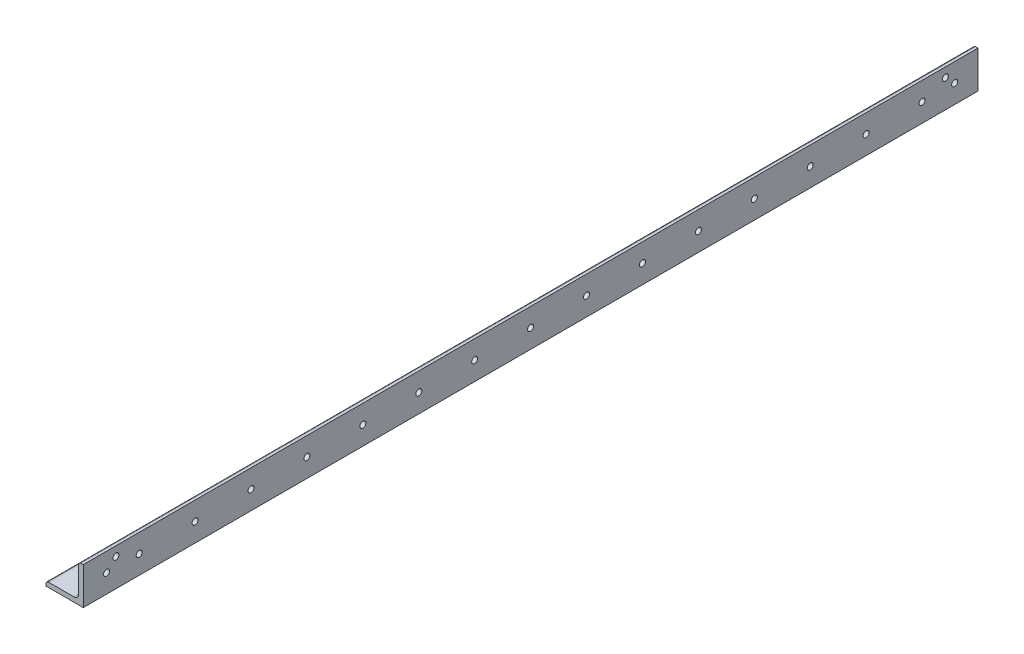
ISO-10303-21;
HEADER;
FILE_DESCRIPTION(('STEP AP214'),'2;1');
FILE_NAME('part.step','',(''),(''),'','','');
FILE_SCHEMA(('AUTOMOTIVE_DESIGN { 1 0 10303 214 1 1 1 1 }'));
ENDSEC;
DATA;
#1=APPLICATION_CONTEXT('core data for automotive mechanical design processes');
#2=APPLICATION_PROTOCOL_DEFINITION('international standard','automotive_design',2000,#1);
#3=PRODUCT_CONTEXT('',#1,'mechanical');
#4=PRODUCT('Part','Part','',(#3));
#5=PRODUCT_RELATED_PRODUCT_CATEGORY('part','',(#4));
#6=PRODUCT_DEFINITION_FORMATION('','',#4);
#7=PRODUCT_DEFINITION_CONTEXT('part definition',#1,'design');
#8=PRODUCT_DEFINITION('design','',#6,#7);
#9=PRODUCT_DEFINITION_SHAPE('','',#8);
#10=(LENGTH_UNIT() NAMED_UNIT(*) SI_UNIT(.MILLI.,.METRE.));
#11=(NAMED_UNIT(*) PLANE_ANGLE_UNIT() SI_UNIT($,.RADIAN.));
#12=(NAMED_UNIT(*) SI_UNIT($,.STERADIAN.) SOLID_ANGLE_UNIT());
#13=UNCERTAINTY_MEASURE_WITH_UNIT(LENGTH_MEASURE(1.E-05),#10,'distance_accuracy_value','');
#14=(GEOMETRIC_REPRESENTATION_CONTEXT(3) GLOBAL_UNCERTAINTY_ASSIGNED_CONTEXT((#13)) GLOBAL_UNIT_ASSIGNED_CONTEXT((#10,
#11,#12)) REPRESENTATION_CONTEXT('',''));
#15=CARTESIAN_POINT('',(0.,0.,0.));
#16=DIRECTION('',(0.,0.,1.));
#17=DIRECTION('',(1.,0.,0.));
#18=AXIS2_PLACEMENT_3D('',#15,#16,#17);
#19=CARTESIAN_POINT('',(-12.7,-11.1125,304.8));
#20=DIRECTION('',(1.,0.,0.));
#21=DIRECTION('',(0.,0.,-1.));
#22=AXIS2_PLACEMENT_3D('',#19,#20,#21);
#23=PLANE('',#22);
#24=DIRECTION('',(0.,-1.,0.));
#25=VECTOR('',#24,1.);
#26=CARTESIAN_POINT('',(-12.7,-11.1125,-304.8));
#27=LINE('',#26,#25);
#28=CARTESIAN_POINT('',(-12.7,-11.1125,-304.8));
#29=VERTEX_POINT('',#28);
#30=CARTESIAN_POINT('',(-12.7,-12.7,-304.8));
#31=VERTEX_POINT('',#30);
#32=EDGE_CURVE('E144',#29,#31,#27,.T.);
#33=ORIENTED_EDGE('',*,*,#32,.T.);
#34=DIRECTION('',(0.,0.,-1.));
#35=VECTOR('',#34,1.);
#36=CARTESIAN_POINT('',(-12.7,-12.7,304.8));
#37=LINE('',#36,#35);
#38=CARTESIAN_POINT('',(-12.7,-12.7,304.8));
#39=VERTEX_POINT('',#38);
#40=EDGE_CURVE('E11',#39,#31,#37,.T.);
#41=ORIENTED_EDGE('',*,*,#40,.F.);
#42=DIRECTION('',(0.,-1.,0.));
#43=VECTOR('',#42,1.);
#44=CARTESIAN_POINT('',(-12.7,-11.1125,304.8));
#45=LINE('',#44,#43);
#46=CARTESIAN_POINT('',(-12.7,-11.1125,304.8));
#47=VERTEX_POINT('',#46);
#48=EDGE_CURVE('E160',#47,#39,#45,.T.);
#49=ORIENTED_EDGE('',*,*,#48,.F.);
#50=DIRECTION('',(0.,0.,-1.));
#51=VECTOR('',#50,1.);
#52=CARTESIAN_POINT('',(-12.7,-11.1125,304.8));
#53=LINE('',#52,#51);
#54=EDGE_CURVE('E140',#47,#29,#53,.T.);
#55=ORIENTED_EDGE('',*,*,#54,.T.);
#56=EDGE_LOOP('',(#33,#41,#49,#55));
#57=FACE_BOUND('',#56,.T.);
#58=ADVANCED_FACE('F40',(#57),#23,.F.);
#59=CARTESIAN_POINT('',(-12.7,-12.7,304.8));
#60=DIRECTION('',(0.,1.,0.));
#61=DIRECTION('',(-1.,0.,0.));
#62=AXIS2_PLACEMENT_3D('',#59,#60,#61);
#63=PLANE('',#62);
#64=DIRECTION('',(1.,0.,0.));
#65=VECTOR('',#64,1.);
#66=CARTESIAN_POINT('',(-12.7,-12.7,-304.8));
#67=LINE('',#66,#65);
#68=CARTESIAN_POINT('',(12.7,-12.7,-304.8));
#69=VERTEX_POINT('',#68);
#70=EDGE_CURVE('E147',#31,#69,#67,.T.);
#71=ORIENTED_EDGE('',*,*,#70,.T.);
#72=DIRECTION('',(0.,0.,-1.));
#73=VECTOR('',#72,1.);
#74=CARTESIAN_POINT('',(12.7,-12.7,304.8));
#75=LINE('',#74,#73);
#76=CARTESIAN_POINT('',(12.7,-12.7,304.8));
#77=VERTEX_POINT('',#76);
#78=EDGE_CURVE('E49',#77,#69,#75,.T.);
#79=ORIENTED_EDGE('',*,*,#78,.F.);
#80=DIRECTION('',(1.,0.,0.));
#81=VECTOR('',#80,1.);
#82=CARTESIAN_POINT('',(-12.7,-12.7,304.8));
#83=LINE('',#82,#81);
#84=EDGE_CURVE('E104',#39,#77,#83,.T.);
#85=ORIENTED_EDGE('',*,*,#84,.F.);
#86=ORIENTED_EDGE('',*,*,#40,.T.);
#87=EDGE_LOOP('',(#71,#79,#85,#86));
#88=FACE_BOUND('',#87,.T.);
#89=ADVANCED_FACE('F248',(#88),#63,.F.);
#90=CARTESIAN_POINT('',(12.7,-12.7,304.8));
#91=DIRECTION('',(-1.,0.,0.));
#92=DIRECTION('',(0.,-1.,0.));
#93=AXIS2_PLACEMENT_3D('',#90,#91,#92);
#94=PLANE('',#93);
#95=CARTESIAN_POINT('',(12.7,0.,-288.925));
#96=DIRECTION('',(1.,0.,0.));
#97=DIRECTION('',(0.,1.,0.));
#98=AXIS2_PLACEMENT_3D('',#95,#96,#97);
#99=CIRCLE('',#98,2.05000000000002);
#100=CARTESIAN_POINT('',(12.7,2.05000000000002,-288.925));
#101=VERTEX_POINT('',#100);
#102=EDGE_CURVE('E179',#101,#101,#99,.T.);
#103=ORIENTED_EDGE('',*,*,#102,.F.);
#104=EDGE_LOOP('',(#103));
#105=FACE_BOUND('',#104,.T.);
#106=CARTESIAN_POINT('',(12.7,6.34999999999996,-282.575));
#107=DIRECTION('',(1.,0.,0.));
#108=DIRECTION('',(0.,1.,0.));
#109=AXIS2_PLACEMENT_3D('',#106,#107,#108);
#110=CIRCLE('',#109,2.05000000000003);
#111=CARTESIAN_POINT('',(12.7,8.39999999999999,-282.575));
#112=VERTEX_POINT('',#111);
#113=EDGE_CURVE('E429',#112,#112,#110,.T.);
#114=ORIENTED_EDGE('',*,*,#113,.F.);
#115=EDGE_LOOP('',(#114));
#116=FACE_BOUND('',#115,.T.);
#117=CARTESIAN_POINT('',(12.7,0.,-266.7));
#118=DIRECTION('',(1.,0.,0.));
#119=DIRECTION('',(0.,1.,0.));
#120=AXIS2_PLACEMENT_3D('',#117,#118,#119);
#121=CIRCLE('',#120,2.05000000000002);
#122=CARTESIAN_POINT('',(12.7,2.05000000000002,-266.7));
#123=VERTEX_POINT('',#122);
#124=EDGE_CURVE('E377',#123,#123,#121,.T.);
#125=ORIENTED_EDGE('',*,*,#124,.F.);
#126=EDGE_LOOP('',(#125));
#127=FACE_BOUND('',#126,.T.);
#128=CARTESIAN_POINT('',(12.7,-2.6431615454387E-13,-228.6));
#129=DIRECTION('',(1.,0.,0.));
#130=DIRECTION('',(0.,1.,0.));
#131=AXIS2_PLACEMENT_3D('',#128,#129,#130);
#132=CIRCLE('',#131,2.05000000000002);
#133=CARTESIAN_POINT('',(12.7,2.04999999999976,-228.6));
#134=VERTEX_POINT('',#133);
#135=EDGE_CURVE('E430',#134,#134,#132,.T.);
#136=ORIENTED_EDGE('',*,*,#135,.F.);
#137=EDGE_LOOP('',(#136));
#138=FACE_BOUND('',#137,.T.);
#139=CARTESIAN_POINT('',(12.7,-5.30367032563717E-13,-190.5));
#140=DIRECTION('',(1.,0.,0.));
#141=DIRECTION('',(0.,1.,0.));
#142=AXIS2_PLACEMENT_3D('',#139,#140,#141);
#143=CIRCLE('',#142,2.05000000000002);
#144=CARTESIAN_POINT('',(12.7,2.04999999999949,-190.5));
#145=VERTEX_POINT('',#144);
#146=EDGE_CURVE('E435',#145,#145,#143,.T.);
#147=ORIENTED_EDGE('',*,*,#146,.F.);
#148=EDGE_LOOP('',(#147));
#149=FACE_BOUND('',#148,.T.);
#150=CARTESIAN_POINT('',(12.7,-7.96417910583564E-13,-152.4));
#151=DIRECTION('',(1.,0.,0.));
#152=DIRECTION('',(0.,1.,0.));
#153=AXIS2_PLACEMENT_3D('',#150,#151,#152);
#154=CIRCLE('',#153,2.05000000000002);
#155=CARTESIAN_POINT('',(12.7,2.04999999999922,-152.4));
#156=VERTEX_POINT('',#155);
#157=EDGE_CURVE('E441',#156,#156,#154,.T.);
#158=ORIENTED_EDGE('',*,*,#157,.F.);
#159=EDGE_LOOP('',(#158));
#160=FACE_BOUND('',#159,.T.);
#161=CARTESIAN_POINT('',(12.7,-1.06246878860341E-12,-114.3));
#162=DIRECTION('',(1.,0.,0.));
#163=DIRECTION('',(0.,1.,0.));
#164=AXIS2_PLACEMENT_3D('',#161,#162,#163);
#165=CIRCLE('',#164,2.05000000000002);
#166=CARTESIAN_POINT('',(12.7,2.04999999999896,-114.3));
#167=VERTEX_POINT('',#166);
#168=EDGE_CURVE('E444',#167,#167,#165,.T.);
#169=ORIENTED_EDGE('',*,*,#168,.F.);
#170=EDGE_LOOP('',(#169));
#171=FACE_BOUND('',#170,.T.);
#172=CARTESIAN_POINT('',(12.7,-1.32851966662326E-12,-76.2));
#173=DIRECTION('',(1.,0.,0.));
#174=DIRECTION('',(0.,1.,0.));
#175=AXIS2_PLACEMENT_3D('',#172,#173,#174);
#176=CIRCLE('',#175,2.05000000000002);
#177=CARTESIAN_POINT('',(12.7,2.04999999999869,-76.2));
#178=VERTEX_POINT('',#177);
#179=EDGE_CURVE('E447',#178,#178,#176,.T.);
#180=ORIENTED_EDGE('',*,*,#179,.F.);
#181=EDGE_LOOP('',(#180));
#182=FACE_BOUND('',#181,.T.);
#183=CARTESIAN_POINT('',(12.7,-1.5945705446431E-12,-38.1));
#184=DIRECTION('',(1.,0.,0.));
#185=DIRECTION('',(0.,1.,0.));
#186=AXIS2_PLACEMENT_3D('',#183,#184,#185);
#187=CIRCLE('',#186,2.05000000000002);
#188=CARTESIAN_POINT('',(12.7,2.04999999999843,-38.1));
#189=VERTEX_POINT('',#188);
#190=EDGE_CURVE('E450',#189,#189,#187,.T.);
#191=ORIENTED_EDGE('',*,*,#190,.F.);
#192=EDGE_LOOP('',(#191));
#193=FACE_BOUND('',#192,.T.);
#194=CARTESIAN_POINT('',(12.7,-1.86062142266295E-12,0.));
#195=DIRECTION('',(1.,0.,0.));
#196=DIRECTION('',(0.,1.,0.));
#197=AXIS2_PLACEMENT_3D('',#194,#195,#196);
#198=CIRCLE('',#197,2.05000000000002);
#199=CARTESIAN_POINT('',(12.7,2.04999999999816,0.));
#200=VERTEX_POINT('',#199);
#201=EDGE_CURVE('E453',#200,#200,#198,.T.);
#202=ORIENTED_EDGE('',*,*,#201,.F.);
#203=EDGE_LOOP('',(#202));
#204=FACE_BOUND('',#203,.T.);
#205=CARTESIAN_POINT('',(12.7,-2.1266723006828E-12,38.1));
#206=DIRECTION('',(1.,0.,0.));
#207=DIRECTION('',(0.,1.,0.));
#208=AXIS2_PLACEMENT_3D('',#205,#206,#207);
#209=CIRCLE('',#208,2.05000000000002);
#210=CARTESIAN_POINT('',(12.7,2.04999999999789,38.1));
#211=VERTEX_POINT('',#210);
#212=EDGE_CURVE('E456',#211,#211,#209,.T.);
#213=ORIENTED_EDGE('',*,*,#212,.F.);
#214=EDGE_LOOP('',(#213));
#215=FACE_BOUND('',#214,.T.);
#216=CARTESIAN_POINT('',(12.7,-2.39272317870265E-12,76.2));
#217=DIRECTION('',(1.,0.,0.));
#218=DIRECTION('',(0.,1.,0.));
#219=AXIS2_PLACEMENT_3D('',#216,#217,#218);
#220=CIRCLE('',#219,2.05000000000002);
#221=CARTESIAN_POINT('',(12.7,2.04999999999763,76.2));
#222=VERTEX_POINT('',#221);
#223=EDGE_CURVE('E459',#222,#222,#220,.T.);
#224=ORIENTED_EDGE('',*,*,#223,.F.);
#225=EDGE_LOOP('',(#224));
#226=FACE_BOUND('',#225,.T.);
#227=CARTESIAN_POINT('',(12.7,-2.65877405672249E-12,114.3));
#228=DIRECTION('',(1.,0.,0.));
#229=DIRECTION('',(0.,1.,0.));
#230=AXIS2_PLACEMENT_3D('',#227,#228,#229);
#231=CIRCLE('',#230,2.05000000000002);
#232=CARTESIAN_POINT('',(12.7,2.04999999999736,114.3));
#233=VERTEX_POINT('',#232);
#234=EDGE_CURVE('E462',#233,#233,#231,.T.);
#235=ORIENTED_EDGE('',*,*,#234,.F.);
#236=EDGE_LOOP('',(#235));
#237=FACE_BOUND('',#236,.T.);
#238=CARTESIAN_POINT('',(12.7,-2.92482493474234E-12,152.4));
#239=DIRECTION('',(1.,0.,0.));
#240=DIRECTION('',(0.,1.,0.));
#241=AXIS2_PLACEMENT_3D('',#238,#239,#240);
#242=CIRCLE('',#241,2.05000000000002);
#243=CARTESIAN_POINT('',(12.7,2.0499999999971,152.4));
#244=VERTEX_POINT('',#243);
#245=EDGE_CURVE('E465',#244,#244,#242,.T.);
#246=ORIENTED_EDGE('',*,*,#245,.F.);
#247=EDGE_LOOP('',(#246));
#248=FACE_BOUND('',#247,.T.);
#249=CARTESIAN_POINT('',(12.7,-3.19087581276219E-12,190.5));
#250=DIRECTION('',(1.,0.,0.));
#251=DIRECTION('',(0.,1.,0.));
#252=AXIS2_PLACEMENT_3D('',#249,#250,#251);
#253=CIRCLE('',#252,2.05000000000002);
#254=CARTESIAN_POINT('',(12.7,2.04999999999683,190.5));
#255=VERTEX_POINT('',#254);
#256=EDGE_CURVE('E468',#255,#255,#253,.T.);
#257=ORIENTED_EDGE('',*,*,#256,.F.);
#258=EDGE_LOOP('',(#257));
#259=FACE_BOUND('',#258,.T.);
#260=CARTESIAN_POINT('',(12.7,-3.45692669078203E-12,228.6));
#261=DIRECTION('',(1.,0.,0.));
#262=DIRECTION('',(0.,1.,0.));
#263=AXIS2_PLACEMENT_3D('',#260,#261,#262);
#264=CIRCLE('',#263,2.05000000000002);
#265=CARTESIAN_POINT('',(12.7,2.04999999999656,228.6));
#266=VERTEX_POINT('',#265);
#267=EDGE_CURVE('E471',#266,#266,#264,.T.);
#268=ORIENTED_EDGE('',*,*,#267,.F.);
#269=EDGE_LOOP('',(#268));
#270=FACE_BOUND('',#269,.T.);
#271=CARTESIAN_POINT('',(12.7,-3.72297756880188E-12,266.7));
#272=DIRECTION('',(1.,0.,0.));
#273=DIRECTION('',(0.,1.,0.));
#274=AXIS2_PLACEMENT_3D('',#271,#272,#273);
#275=CIRCLE('',#274,2.05000000000002);
#276=CARTESIAN_POINT('',(12.7,2.0499999999963,266.7));
#277=VERTEX_POINT('',#276);
#278=EDGE_CURVE('E474',#277,#277,#275,.T.);
#279=ORIENTED_EDGE('',*,*,#278,.F.);
#280=EDGE_LOOP('',(#279));
#281=FACE_BOUND('',#280,.T.);
#282=CARTESIAN_POINT('',(12.7,6.34999999999996,282.575));
#283=DIRECTION('',(1.,0.,0.));
#284=DIRECTION('',(0.,-1.,0.));
#285=AXIS2_PLACEMENT_3D('',#282,#283,#284);
#286=CIRCLE('',#285,2.05000000000003);
#287=CARTESIAN_POINT('',(12.7,4.29999999999992,282.575));
#288=VERTEX_POINT('',#287);
#289=EDGE_CURVE('E477',#288,#288,#286,.T.);
#290=ORIENTED_EDGE('',*,*,#289,.F.);
#291=EDGE_LOOP('',(#290));
#292=FACE_BOUND('',#291,.T.);
#293=CARTESIAN_POINT('',(12.7,0.,288.925));
#294=DIRECTION('',(1.,0.,0.));
#295=DIRECTION('',(0.,-1.,0.));
#296=AXIS2_PLACEMENT_3D('',#293,#294,#295);
#297=CIRCLE('',#296,2.05000000000002);
#298=CARTESIAN_POINT('',(12.7,-2.05000000000002,288.925));
#299=VERTEX_POINT('',#298);
#300=EDGE_CURVE('E480',#299,#299,#297,.T.);
#301=ORIENTED_EDGE('',*,*,#300,.F.);
#302=EDGE_LOOP('',(#301));
#303=FACE_BOUND('',#302,.T.);
#304=DIRECTION('',(0.,1.,0.));
#305=VECTOR('',#304,1.);
#306=CARTESIAN_POINT('',(12.7,-12.7,-304.8));
#307=LINE('',#306,#305);
#308=CARTESIAN_POINT('',(12.7,12.7,-304.8));
#309=VERTEX_POINT('',#308);
#310=EDGE_CURVE('E149',#69,#309,#307,.T.);
#311=ORIENTED_EDGE('',*,*,#310,.T.);
#312=DIRECTION('',(0.,0.,-1.));
#313=VECTOR('',#312,1.);
#314=CARTESIAN_POINT('',(12.7,12.7,304.8));
#315=LINE('',#314,#313);
#316=CARTESIAN_POINT('',(12.7,12.7,304.8));
#317=VERTEX_POINT('',#316);
#318=EDGE_CURVE('E170',#317,#309,#315,.T.);
#319=ORIENTED_EDGE('',*,*,#318,.F.);
#320=DIRECTION('',(0.,1.,0.));
#321=VECTOR('',#320,1.);
#322=CARTESIAN_POINT('',(12.7,-12.7,304.8));
#323=LINE('',#322,#321);
#324=EDGE_CURVE('E264',#77,#317,#323,.T.);
#325=ORIENTED_EDGE('',*,*,#324,.F.);
#326=ORIENTED_EDGE('',*,*,#78,.T.);
#327=EDGE_LOOP('',(#311,#319,#325,#326));
#328=FACE_BOUND('',#327,.T.);
#329=ADVANCED_FACE('F253',(#105,#116,#127,#138,#149,#160,#171,#182,#193,#204,#215,#226,#237,
#248,#259,#270,#281,#292,#303,#328),#94,.F.);
#330=CARTESIAN_POINT('',(11.1125,12.7,304.8));
#331=DIRECTION('',(0.,-1.,0.));
#332=DIRECTION('',(0.,0.,-1.));
#333=AXIS2_PLACEMENT_3D('',#330,#331,#332);
#334=PLANE('',#333);
#335=DIRECTION('',(-1.,0.,0.));
#336=VECTOR('',#335,1.);
#337=CARTESIAN_POINT('',(11.1125,12.7,-304.8));
#338=LINE('',#337,#336);
#339=CARTESIAN_POINT('',(11.1125,12.7,-304.8));
#340=VERTEX_POINT('',#339);
#341=EDGE_CURVE('E151',#309,#340,#338,.T.);
#342=ORIENTED_EDGE('',*,*,#341,.T.);
#343=DIRECTION('',(0.,0.,-1.));
#344=VECTOR('',#343,1.);
#345=CARTESIAN_POINT('',(11.1125,12.7,304.8));
#346=LINE('',#345,#344);
#347=CARTESIAN_POINT('',(11.1125,12.7,304.8));
#348=VERTEX_POINT('',#347);
#349=EDGE_CURVE('E167',#348,#340,#346,.T.);
#350=ORIENTED_EDGE('',*,*,#349,.F.);
#351=DIRECTION('',(-1.,0.,0.));
#352=VECTOR('',#351,1.);
#353=CARTESIAN_POINT('',(11.1125,12.7,304.8));
#354=LINE('',#353,#352);
#355=EDGE_CURVE('E266',#317,#348,#354,.T.);
#356=ORIENTED_EDGE('',*,*,#355,.F.);
#357=ORIENTED_EDGE('',*,*,#318,.T.);
#358=EDGE_LOOP('',(#342,#350,#356,#357));
#359=FACE_BOUND('',#358,.T.);
#360=ADVANCED_FACE('F282',(#359),#334,.F.);
#361=CARTESIAN_POINT('',(11.1125,11.1125,304.8));
#362=DIRECTION('',(0.,0.,-1.));
#363=DIRECTION('',(-1.,0.,0.));
#364=AXIS2_PLACEMENT_3D('',#361,#362,#363);
#365=CYLINDRICAL_SURFACE('',#364,1.5875);
#366=CARTESIAN_POINT('',(11.1125,11.1125,-304.8));
#367=DIRECTION('',(0.,0.,1.));
#368=DIRECTION('',(-1.,0.,0.));
#369=AXIS2_PLACEMENT_3D('',#366,#367,#368);
#370=CIRCLE('',#369,1.5875);
#371=CARTESIAN_POINT('',(9.525,11.1125,-304.8));
#372=VERTEX_POINT('',#371);
#373=EDGE_CURVE('E153',#340,#372,#370,.T.);
#374=ORIENTED_EDGE('',*,*,#373,.T.);
#375=DIRECTION('',(0.,0.,-1.));
#376=VECTOR('',#375,1.);
#377=CARTESIAN_POINT('',(9.525,11.1125,304.8));
#378=LINE('',#377,#376);
#379=CARTESIAN_POINT('',(9.525,11.1125,304.8));
#380=VERTEX_POINT('',#379);
#381=EDGE_CURVE('E164',#380,#372,#378,.T.);
#382=ORIENTED_EDGE('',*,*,#381,.F.);
#383=CARTESIAN_POINT('',(11.1125,11.1125,304.8));
#384=DIRECTION('',(0.,0.,1.));
#385=DIRECTION('',(-1.,0.,0.));
#386=AXIS2_PLACEMENT_3D('',#383,#384,#385);
#387=CIRCLE('',#386,1.5875);
#388=EDGE_CURVE('E268',#348,#380,#387,.T.);
#389=ORIENTED_EDGE('',*,*,#388,.F.);
#390=ORIENTED_EDGE('',*,*,#349,.T.);
#391=EDGE_LOOP('',(#374,#382,#389,#390));
#392=FACE_BOUND('',#391,.T.);
#393=ADVANCED_FACE('F277',(#392),#365,.T.);
#394=CARTESIAN_POINT('',(9.525,11.1125,304.8));
#395=DIRECTION('',(1.,0.,0.));
#396=DIRECTION('',(0.,1.,0.));
#397=AXIS2_PLACEMENT_3D('',#394,#395,#396);
#398=PLANE('',#397);
#399=CARTESIAN_POINT('',(9.525,0.,-288.925));
#400=DIRECTION('',(1.,0.,0.));
#401=DIRECTION('',(0.,1.,0.));
#402=AXIS2_PLACEMENT_3D('',#399,#400,#401);
#403=CIRCLE('',#402,2.05000000000002);
#404=CARTESIAN_POINT('',(9.525,2.05000000000002,-288.925));
#405=VERTEX_POINT('',#404);
#406=EDGE_CURVE('E43',#405,#405,#403,.T.);
#407=ORIENTED_EDGE('',*,*,#406,.T.);
#408=EDGE_LOOP('',(#407));
#409=FACE_BOUND('',#408,.T.);
#410=CARTESIAN_POINT('',(9.525,6.34999999999996,-282.575));
#411=DIRECTION('',(1.,0.,0.));
#412=DIRECTION('',(0.,1.,0.));
#413=AXIS2_PLACEMENT_3D('',#410,#411,#412);
#414=CIRCLE('',#413,2.05000000000003);
#415=CARTESIAN_POINT('',(9.525,8.39999999999999,-282.575));
#416=VERTEX_POINT('',#415);
#417=EDGE_CURVE('E226',#416,#416,#414,.T.);
#418=ORIENTED_EDGE('',*,*,#417,.T.);
#419=EDGE_LOOP('',(#418));
#420=FACE_BOUND('',#419,.T.);
#421=CARTESIAN_POINT('',(9.525,0.,-266.7));
#422=DIRECTION('',(1.,0.,0.));
#423=DIRECTION('',(0.,1.,0.));
#424=AXIS2_PLACEMENT_3D('',#421,#422,#423);
#425=CIRCLE('',#424,2.05000000000002);
#426=CARTESIAN_POINT('',(9.525,2.05000000000002,-266.7));
#427=VERTEX_POINT('',#426);
#428=EDGE_CURVE('E224',#427,#427,#425,.T.);
#429=ORIENTED_EDGE('',*,*,#428,.T.);
#430=EDGE_LOOP('',(#429));
#431=FACE_BOUND('',#430,.T.);
#432=CARTESIAN_POINT('',(9.525,-2.64749835412864E-13,-228.6));
#433=DIRECTION('',(1.,0.,0.));
#434=DIRECTION('',(0.,1.,0.));
#435=AXIS2_PLACEMENT_3D('',#432,#433,#434);
#436=CIRCLE('',#435,2.05000000000002);
#437=CARTESIAN_POINT('',(9.525,2.04999999999976,-228.6));
#438=VERTEX_POINT('',#437);
#439=EDGE_CURVE('E221',#438,#438,#436,.T.);
#440=ORIENTED_EDGE('',*,*,#439,.T.);
#441=EDGE_LOOP('',(#440));
#442=FACE_BOUND('',#441,.T.);
#443=CARTESIAN_POINT('',(9.525,-5.30800713432711E-13,-190.5));
#444=DIRECTION('',(1.,0.,0.));
#445=DIRECTION('',(0.,1.,0.));
#446=AXIS2_PLACEMENT_3D('',#443,#444,#445);
#447=CIRCLE('',#446,2.05000000000002);
#448=CARTESIAN_POINT('',(9.525,2.04999999999949,-190.5));
#449=VERTEX_POINT('',#448);
#450=EDGE_CURVE('E218',#449,#449,#447,.T.);
#451=ORIENTED_EDGE('',*,*,#450,.T.);
#452=EDGE_LOOP('',(#451));
#453=FACE_BOUND('',#452,.T.);
#454=CARTESIAN_POINT('',(9.525,-7.96851591452558E-13,-152.4));
#455=DIRECTION('',(1.,0.,0.));
#456=DIRECTION('',(0.,1.,0.));
#457=AXIS2_PLACEMENT_3D('',#454,#455,#456);
#458=CIRCLE('',#457,2.05000000000002);
#459=CARTESIAN_POINT('',(9.525,2.04999999999922,-152.4));
#460=VERTEX_POINT('',#459);
#461=EDGE_CURVE('E215',#460,#460,#458,.T.);
#462=ORIENTED_EDGE('',*,*,#461,.T.);
#463=EDGE_LOOP('',(#462));
#464=FACE_BOUND('',#463,.T.);
#465=CARTESIAN_POINT('',(9.525,-1.0629024694724E-12,-114.3));
#466=DIRECTION('',(1.,0.,0.));
#467=DIRECTION('',(0.,1.,0.));
#468=AXIS2_PLACEMENT_3D('',#465,#466,#467);
#469=CIRCLE('',#468,2.05000000000002);
#470=CARTESIAN_POINT('',(9.525,2.04999999999896,-114.3));
#471=VERTEX_POINT('',#470);
#472=EDGE_CURVE('E212',#471,#471,#469,.T.);
#473=ORIENTED_EDGE('',*,*,#472,.T.);
#474=EDGE_LOOP('',(#473));
#475=FACE_BOUND('',#474,.T.);
#476=CARTESIAN_POINT('',(9.525,-1.32895334749225E-12,-76.2));
#477=DIRECTION('',(1.,0.,0.));
#478=DIRECTION('',(0.,1.,0.));
#479=AXIS2_PLACEMENT_3D('',#476,#477,#478);
#480=CIRCLE('',#479,2.05000000000002);
#481=CARTESIAN_POINT('',(9.525,2.04999999999869,-76.2));
#482=VERTEX_POINT('',#481);
#483=EDGE_CURVE('E209',#482,#482,#480,.T.);
#484=ORIENTED_EDGE('',*,*,#483,.T.);
#485=EDGE_LOOP('',(#484));
#486=FACE_BOUND('',#485,.T.);
#487=CARTESIAN_POINT('',(9.525,-1.5950042255121E-12,-38.1));
#488=DIRECTION('',(1.,0.,0.));
#489=DIRECTION('',(0.,1.,0.));
#490=AXIS2_PLACEMENT_3D('',#487,#488,#489);
#491=CIRCLE('',#490,2.05000000000002);
#492=CARTESIAN_POINT('',(9.525,2.04999999999842,-38.1));
#493=VERTEX_POINT('',#492);
#494=EDGE_CURVE('E206',#493,#493,#491,.T.);
#495=ORIENTED_EDGE('',*,*,#494,.T.);
#496=EDGE_LOOP('',(#495));
#497=FACE_BOUND('',#496,.T.);
#498=CARTESIAN_POINT('',(9.525,-1.86105510353195E-12,0.));
#499=DIRECTION('',(1.,0.,0.));
#500=DIRECTION('',(0.,1.,0.));
#501=AXIS2_PLACEMENT_3D('',#498,#499,#500);
#502=CIRCLE('',#501,2.05000000000002);
#503=CARTESIAN_POINT('',(9.525,2.04999999999816,0.));
#504=VERTEX_POINT('',#503);
#505=EDGE_CURVE('E203',#504,#504,#502,.T.);
#506=ORIENTED_EDGE('',*,*,#505,.T.);
#507=EDGE_LOOP('',(#506));
#508=FACE_BOUND('',#507,.T.);
#509=CARTESIAN_POINT('',(9.525,-2.12710598155179E-12,38.1));
#510=DIRECTION('',(1.,0.,0.));
#511=DIRECTION('',(0.,1.,0.));
#512=AXIS2_PLACEMENT_3D('',#509,#510,#511);
#513=CIRCLE('',#512,2.05000000000002);
#514=CARTESIAN_POINT('',(9.525,2.04999999999789,38.1));
#515=VERTEX_POINT('',#514);
#516=EDGE_CURVE('E200',#515,#515,#513,.T.);
#517=ORIENTED_EDGE('',*,*,#516,.T.);
#518=EDGE_LOOP('',(#517));
#519=FACE_BOUND('',#518,.T.);
#520=CARTESIAN_POINT('',(9.525,-2.39315685957164E-12,76.2));
#521=DIRECTION('',(1.,0.,0.));
#522=DIRECTION('',(0.,1.,0.));
#523=AXIS2_PLACEMENT_3D('',#520,#521,#522);
#524=CIRCLE('',#523,2.05000000000002);
#525=CARTESIAN_POINT('',(9.525,2.04999999999763,76.2));
#526=VERTEX_POINT('',#525);
#527=EDGE_CURVE('E197',#526,#526,#524,.T.);
#528=ORIENTED_EDGE('',*,*,#527,.T.);
#529=EDGE_LOOP('',(#528));
#530=FACE_BOUND('',#529,.T.);
#531=CARTESIAN_POINT('',(9.525,-2.65920773759149E-12,114.3));
#532=DIRECTION('',(1.,0.,0.));
#533=DIRECTION('',(0.,1.,0.));
#534=AXIS2_PLACEMENT_3D('',#531,#532,#533);
#535=CIRCLE('',#534,2.05000000000002);
#536=CARTESIAN_POINT('',(9.525,2.04999999999736,114.3));
#537=VERTEX_POINT('',#536);
#538=EDGE_CURVE('E194',#537,#537,#535,.T.);
#539=ORIENTED_EDGE('',*,*,#538,.T.);
#540=EDGE_LOOP('',(#539));
#541=FACE_BOUND('',#540,.T.);
#542=CARTESIAN_POINT('',(9.525,-2.92525861561133E-12,152.4));
#543=DIRECTION('',(1.,0.,0.));
#544=DIRECTION('',(0.,1.,0.));
#545=AXIS2_PLACEMENT_3D('',#542,#543,#544);
#546=CIRCLE('',#545,2.05000000000002);
#547=CARTESIAN_POINT('',(9.525,2.04999999999709,152.4));
#548=VERTEX_POINT('',#547);
#549=EDGE_CURVE('E191',#548,#548,#546,.T.);
#550=ORIENTED_EDGE('',*,*,#549,.T.);
#551=EDGE_LOOP('',(#550));
#552=FACE_BOUND('',#551,.T.);
#553=CARTESIAN_POINT('',(9.525,-3.19130949363118E-12,190.5));
#554=DIRECTION('',(1.,0.,0.));
#555=DIRECTION('',(0.,1.,0.));
#556=AXIS2_PLACEMENT_3D('',#553,#554,#555);
#557=CIRCLE('',#556,2.05000000000002);
#558=CARTESIAN_POINT('',(9.525,2.04999999999683,190.5));
#559=VERTEX_POINT('',#558);
#560=EDGE_CURVE('E188',#559,#559,#557,.T.);
#561=ORIENTED_EDGE('',*,*,#560,.T.);
#562=EDGE_LOOP('',(#561));
#563=FACE_BOUND('',#562,.T.);
#564=CARTESIAN_POINT('',(9.525,-3.45736037165103E-12,228.6));
#565=DIRECTION('',(1.,0.,0.));
#566=DIRECTION('',(0.,1.,0.));
#567=AXIS2_PLACEMENT_3D('',#564,#565,#566);
#568=CIRCLE('',#567,2.05000000000002);
#569=CARTESIAN_POINT('',(9.525,2.04999999999656,228.6));
#570=VERTEX_POINT('',#569);
#571=EDGE_CURVE('E185',#570,#570,#568,.T.);
#572=ORIENTED_EDGE('',*,*,#571,.T.);
#573=EDGE_LOOP('',(#572));
#574=FACE_BOUND('',#573,.T.);
#575=CARTESIAN_POINT('',(9.525,-3.72341124967087E-12,266.7));
#576=DIRECTION('',(1.,0.,0.));
#577=DIRECTION('',(0.,1.,0.));
#578=AXIS2_PLACEMENT_3D('',#575,#576,#577);
#579=CIRCLE('',#578,2.05000000000002);
#580=CARTESIAN_POINT('',(9.525,2.0499999999963,266.7));
#581=VERTEX_POINT('',#580);
#582=EDGE_CURVE('E182',#581,#581,#579,.T.);
#583=ORIENTED_EDGE('',*,*,#582,.T.);
#584=EDGE_LOOP('',(#583));
#585=FACE_BOUND('',#584,.T.);
#586=CARTESIAN_POINT('',(9.525,6.34999999999996,282.575));
#587=DIRECTION('',(1.,0.,0.));
#588=DIRECTION('',(0.,1.,0.));
#589=AXIS2_PLACEMENT_3D('',#586,#587,#588);
#590=CIRCLE('',#589,2.05000000000003);
#591=CARTESIAN_POINT('',(9.525,8.39999999999999,282.575));
#592=VERTEX_POINT('',#591);
#593=EDGE_CURVE('E178',#592,#592,#590,.T.);
#594=ORIENTED_EDGE('',*,*,#593,.T.);
#595=EDGE_LOOP('',(#594));
#596=FACE_BOUND('',#595,.T.);
#597=CARTESIAN_POINT('',(9.525,0.,288.925));
#598=DIRECTION('',(1.,0.,0.));
#599=DIRECTION('',(0.,1.,0.));
#600=AXIS2_PLACEMENT_3D('',#597,#598,#599);
#601=CIRCLE('',#600,2.05000000000002);
#602=CARTESIAN_POINT('',(9.525,2.05000000000002,288.925));
#603=VERTEX_POINT('',#602);
#604=EDGE_CURVE('E175',#603,#603,#601,.T.);
#605=ORIENTED_EDGE('',*,*,#604,.T.);
#606=EDGE_LOOP('',(#605));
#607=FACE_BOUND('',#606,.T.);
#608=DIRECTION('',(0.,-1.,0.));
#609=VECTOR('',#608,1.);
#610=CARTESIAN_POINT('',(9.525,11.1125,-304.8));
#611=LINE('',#610,#609);
#612=CARTESIAN_POINT('',(9.525,-6.35,-304.8));
#613=VERTEX_POINT('',#612);
#614=EDGE_CURVE('E155',#372,#613,#611,.T.);
#615=ORIENTED_EDGE('',*,*,#614,.T.);
#616=DIRECTION('',(0.,0.,-1.));
#617=VECTOR('',#616,1.);
#618=CARTESIAN_POINT('',(9.525,-6.35,304.8));
#619=LINE('',#618,#617);
#620=CARTESIAN_POINT('',(9.525,-6.35,304.8));
#621=VERTEX_POINT('',#620);
#622=EDGE_CURVE('E135',#621,#613,#619,.T.);
#623=ORIENTED_EDGE('',*,*,#622,.F.);
#624=DIRECTION('',(0.,-1.,0.));
#625=VECTOR('',#624,1.);
#626=CARTESIAN_POINT('',(9.525,11.1125,304.8));
#627=LINE('',#626,#625);
#628=EDGE_CURVE('E126',#380,#621,#627,.T.);
#629=ORIENTED_EDGE('',*,*,#628,.F.);
#630=ORIENTED_EDGE('',*,*,#381,.T.);
#631=EDGE_LOOP('',(#615,#623,#629,#630));
#632=FACE_BOUND('',#631,.T.);
#633=ADVANCED_FACE('F233',(#409,#420,#431,#442,#453,#464,#475,#486,#497,#508,#519,#530,#541,
#552,#563,#574,#585,#596,#607,#632),#398,.F.);
#634=CARTESIAN_POINT('',(6.35,-6.35,304.8));
#635=DIRECTION('',(0.,0.,-1.));
#636=DIRECTION('',(-1.,0.,0.));
#637=AXIS2_PLACEMENT_3D('',#634,#635,#636);
#638=CYLINDRICAL_SURFACE('',#637,3.175);
#639=CARTESIAN_POINT('',(6.35,-6.35,-304.8));
#640=DIRECTION('',(0.,0.,-1.));
#641=DIRECTION('',(-1.,0.,0.));
#642=AXIS2_PLACEMENT_3D('',#639,#640,#641);
#643=CIRCLE('',#642,3.175);
#644=CARTESIAN_POINT('',(6.35,-9.525,-304.8));
#645=VERTEX_POINT('',#644);
#646=EDGE_CURVE('E134',#613,#645,#643,.T.);
#647=ORIENTED_EDGE('',*,*,#646,.T.);
#648=DIRECTION('',(0.,0.,-1.));
#649=VECTOR('',#648,1.);
#650=CARTESIAN_POINT('',(6.35,-9.525,304.8));
#651=LINE('',#650,#649);
#652=CARTESIAN_POINT('',(6.35,-9.525,304.8));
#653=VERTEX_POINT('',#652);
#654=EDGE_CURVE('E131',#653,#645,#651,.T.);
#655=ORIENTED_EDGE('',*,*,#654,.F.);
#656=CARTESIAN_POINT('',(6.35,-6.35,304.8));
#657=DIRECTION('',(0.,0.,-1.));
#658=DIRECTION('',(-1.,0.,0.));
#659=AXIS2_PLACEMENT_3D('',#656,#657,#658);
#660=CIRCLE('',#659,3.175);
#661=EDGE_CURVE('E120',#621,#653,#660,.T.);
#662=ORIENTED_EDGE('',*,*,#661,.F.);
#663=ORIENTED_EDGE('',*,*,#622,.T.);
#664=EDGE_LOOP('',(#647,#655,#662,#663));
#665=FACE_BOUND('',#664,.T.);
#666=ADVANCED_FACE('F132',(#665),#638,.F.);
#667=CARTESIAN_POINT('',(6.35,-9.525,304.8));
#668=DIRECTION('',(0.,-1.,0.));
#669=DIRECTION('',(1.,0.,0.));
#670=AXIS2_PLACEMENT_3D('',#667,#668,#669);
#671=PLANE('',#670);
#672=DIRECTION('',(-1.,0.,0.));
#673=VECTOR('',#672,1.);
#674=CARTESIAN_POINT('',(6.35,-9.525,-304.8));
#675=LINE('',#674,#673);
#676=CARTESIAN_POINT('',(-11.1125,-9.525,-304.8));
#677=VERTEX_POINT('',#676);
#678=EDGE_CURVE('E90',#645,#677,#675,.T.);
#679=ORIENTED_EDGE('',*,*,#678,.T.);
#680=DIRECTION('',(0.,0.,-1.));
#681=VECTOR('',#680,1.);
#682=CARTESIAN_POINT('',(-11.1125,-9.525,304.8));
#683=LINE('',#682,#681);
#684=CARTESIAN_POINT('',(-11.1125,-9.525,304.8));
#685=VERTEX_POINT('',#684);
#686=EDGE_CURVE('E136',#685,#677,#683,.T.);
#687=ORIENTED_EDGE('',*,*,#686,.F.);
#688=DIRECTION('',(-1.,0.,0.));
#689=VECTOR('',#688,1.);
#690=CARTESIAN_POINT('',(6.35,-9.525,304.8));
#691=LINE('',#690,#689);
#692=EDGE_CURVE('E124',#653,#685,#691,.T.);
#693=ORIENTED_EDGE('',*,*,#692,.F.);
#694=ORIENTED_EDGE('',*,*,#654,.T.);
#695=EDGE_LOOP('',(#679,#687,#693,#694));
#696=FACE_BOUND('',#695,.T.);
#697=ADVANCED_FACE('F138',(#696),#671,.F.);
#698=CARTESIAN_POINT('',(-11.1125,-11.1125,304.8));
#699=DIRECTION('',(0.,0.,-1.));
#700=DIRECTION('',(-1.,0.,0.));
#701=AXIS2_PLACEMENT_3D('',#698,#699,#700);
#702=CYLINDRICAL_SURFACE('',#701,1.5875);
#703=CARTESIAN_POINT('',(-11.1125,-11.1125,-304.8));
#704=DIRECTION('',(0.,0.,1.));
#705=DIRECTION('',(-1.,0.,0.));
#706=AXIS2_PLACEMENT_3D('',#703,#704,#705);
#707=CIRCLE('',#706,1.5875);
#708=EDGE_CURVE('E96',#677,#29,#707,.T.);
#709=ORIENTED_EDGE('',*,*,#708,.T.);
#710=ORIENTED_EDGE('',*,*,#54,.F.);
#711=CARTESIAN_POINT('',(-11.1125,-11.1125,304.8));
#712=DIRECTION('',(0.,0.,1.));
#713=DIRECTION('',(-1.,0.,0.));
#714=AXIS2_PLACEMENT_3D('',#711,#712,#713);
#715=CIRCLE('',#714,1.5875);
#716=EDGE_CURVE('E58',#685,#47,#715,.T.);
#717=ORIENTED_EDGE('',*,*,#716,.F.);
#718=ORIENTED_EDGE('',*,*,#686,.T.);
#719=EDGE_LOOP('',(#709,#710,#717,#718));
#720=FACE_BOUND('',#719,.T.);
#721=ADVANCED_FACE('F299',(#720),#702,.T.);
#722=CARTESIAN_POINT('',(11.1125,11.1125,304.8));
#723=DIRECTION('',(0.,0.,-1.));
#724=DIRECTION('',(-1.,0.,0.));
#725=AXIS2_PLACEMENT_3D('',#722,#723,#724);
#726=PLANE('',#725);
#727=ORIENTED_EDGE('',*,*,#48,.T.);
#728=ORIENTED_EDGE('',*,*,#84,.T.);
#729=ORIENTED_EDGE('',*,*,#324,.T.);
#730=ORIENTED_EDGE('',*,*,#355,.T.);
#731=ORIENTED_EDGE('',*,*,#388,.T.);
#732=ORIENTED_EDGE('',*,*,#628,.T.);
#733=ORIENTED_EDGE('',*,*,#661,.T.);
#734=ORIENTED_EDGE('',*,*,#692,.T.);
#735=ORIENTED_EDGE('',*,*,#716,.T.);
#736=EDGE_LOOP('',(#727,#728,#729,#730,#731,#732,#733,#734,#735));
#737=FACE_BOUND('',#736,.T.);
#738=ADVANCED_FACE('F122',(#737),#726,.F.);
#739=CARTESIAN_POINT('',(11.1125,11.1125,-304.8));
#740=DIRECTION('',(0.,0.,-1.));
#741=DIRECTION('',(-1.,0.,0.));
#742=AXIS2_PLACEMENT_3D('',#739,#740,#741);
#743=PLANE('',#742);
#744=ORIENTED_EDGE('',*,*,#32,.F.);
#745=ORIENTED_EDGE('',*,*,#708,.F.);
#746=ORIENTED_EDGE('',*,*,#678,.F.);
#747=ORIENTED_EDGE('',*,*,#646,.F.);
#748=ORIENTED_EDGE('',*,*,#614,.F.);
#749=ORIENTED_EDGE('',*,*,#373,.F.);
#750=ORIENTED_EDGE('',*,*,#341,.F.);
#751=ORIENTED_EDGE('',*,*,#310,.F.);
#752=ORIENTED_EDGE('',*,*,#70,.F.);
#753=EDGE_LOOP('',(#744,#745,#746,#747,#748,#749,#750,#751,#752));
#754=FACE_BOUND('',#753,.T.);
#755=ADVANCED_FACE('F258',(#754),#743,.T.);
#756=CARTESIAN_POINT('',(-38.1,0.,288.925));
#757=DIRECTION('',(1.,0.,0.));
#758=DIRECTION('',(0.,1.,0.));
#759=AXIS2_PLACEMENT_3D('',#756,#757,#758);
#760=CYLINDRICAL_SURFACE('',#759,2.05000000000002);
#761=ORIENTED_EDGE('',*,*,#300,.T.);
#762=EDGE_LOOP('',(#761));
#763=FACE_BOUND('',#762,.T.);
#764=ORIENTED_EDGE('',*,*,#604,.F.);
#765=EDGE_LOOP('',(#764));
#766=FACE_BOUND('',#765,.T.);
#767=ADVANCED_FACE('F304',(#763,#766),#760,.F.);
#768=CARTESIAN_POINT('',(-38.1,6.34999999999995,282.575));
#769=DIRECTION('',(1.,0.,0.));
#770=DIRECTION('',(0.,1.,0.));
#771=AXIS2_PLACEMENT_3D('',#768,#769,#770);
#772=CYLINDRICAL_SURFACE('',#771,2.05000000000003);
#773=ORIENTED_EDGE('',*,*,#289,.T.);
#774=EDGE_LOOP('',(#773));
#775=FACE_BOUND('',#774,.T.);
#776=ORIENTED_EDGE('',*,*,#593,.F.);
#777=EDGE_LOOP('',(#776));
#778=FACE_BOUND('',#777,.T.);
#779=ADVANCED_FACE('F309',(#775,#778),#772,.F.);
#780=CARTESIAN_POINT('',(-38.1,-3.72991646270579E-12,266.7));
#781=DIRECTION('',(1.,0.,0.));
#782=DIRECTION('',(0.,1.,0.));
#783=AXIS2_PLACEMENT_3D('',#780,#781,#782);
#784=CYLINDRICAL_SURFACE('',#783,2.05000000000002);
#785=ORIENTED_EDGE('',*,*,#278,.T.);
#786=EDGE_LOOP('',(#785));
#787=FACE_BOUND('',#786,.T.);
#788=ORIENTED_EDGE('',*,*,#582,.F.);
#789=EDGE_LOOP('',(#788));
#790=FACE_BOUND('',#789,.T.);
#791=ADVANCED_FACE('F313',(#787,#790),#784,.F.);
#792=CARTESIAN_POINT('',(-38.1,-3.46386558468594E-12,228.6));
#793=DIRECTION('',(1.,0.,0.));
#794=DIRECTION('',(0.,1.,0.));
#795=AXIS2_PLACEMENT_3D('',#792,#793,#794);
#796=CYLINDRICAL_SURFACE('',#795,2.05000000000002);
#797=ORIENTED_EDGE('',*,*,#267,.T.);
#798=EDGE_LOOP('',(#797));
#799=FACE_BOUND('',#798,.T.);
#800=ORIENTED_EDGE('',*,*,#571,.F.);
#801=EDGE_LOOP('',(#800));
#802=FACE_BOUND('',#801,.T.);
#803=ADVANCED_FACE('F317',(#799,#802),#796,.F.);
#804=CARTESIAN_POINT('',(-38.1,-3.19781470666609E-12,190.5));
#805=DIRECTION('',(1.,0.,0.));
#806=DIRECTION('',(0.,1.,0.));
#807=AXIS2_PLACEMENT_3D('',#804,#805,#806);
#808=CYLINDRICAL_SURFACE('',#807,2.05000000000002);
#809=ORIENTED_EDGE('',*,*,#256,.T.);
#810=EDGE_LOOP('',(#809));
#811=FACE_BOUND('',#810,.T.);
#812=ORIENTED_EDGE('',*,*,#560,.F.);
#813=EDGE_LOOP('',(#812));
#814=FACE_BOUND('',#813,.T.);
#815=ADVANCED_FACE('F321',(#811,#814),#808,.F.);
#816=CARTESIAN_POINT('',(-38.1,-2.93176382864625E-12,152.4));
#817=DIRECTION('',(1.,0.,0.));
#818=DIRECTION('',(0.,1.,0.));
#819=AXIS2_PLACEMENT_3D('',#816,#817,#818);
#820=CYLINDRICAL_SURFACE('',#819,2.05000000000002);
#821=ORIENTED_EDGE('',*,*,#245,.T.);
#822=EDGE_LOOP('',(#821));
#823=FACE_BOUND('',#822,.T.);
#824=ORIENTED_EDGE('',*,*,#549,.F.);
#825=EDGE_LOOP('',(#824));
#826=FACE_BOUND('',#825,.T.);
#827=ADVANCED_FACE('F325',(#823,#826),#820,.F.);
#828=CARTESIAN_POINT('',(-38.1,-2.6657129506264E-12,114.3));
#829=DIRECTION('',(1.,0.,0.));
#830=DIRECTION('',(0.,1.,0.));
#831=AXIS2_PLACEMENT_3D('',#828,#829,#830);
#832=CYLINDRICAL_SURFACE('',#831,2.05000000000002);
#833=ORIENTED_EDGE('',*,*,#234,.T.);
#834=EDGE_LOOP('',(#833));
#835=FACE_BOUND('',#834,.T.);
#836=ORIENTED_EDGE('',*,*,#538,.F.);
#837=EDGE_LOOP('',(#836));
#838=FACE_BOUND('',#837,.T.);
#839=ADVANCED_FACE('F329',(#835,#838),#832,.F.);
#840=CARTESIAN_POINT('',(-38.1,-2.39966207260655E-12,76.2));
#841=DIRECTION('',(1.,0.,0.));
#842=DIRECTION('',(0.,1.,0.));
#843=AXIS2_PLACEMENT_3D('',#840,#841,#842);
#844=CYLINDRICAL_SURFACE('',#843,2.05000000000002);
#845=ORIENTED_EDGE('',*,*,#223,.T.);
#846=EDGE_LOOP('',(#845));
#847=FACE_BOUND('',#846,.T.);
#848=ORIENTED_EDGE('',*,*,#527,.F.);
#849=EDGE_LOOP('',(#848));
#850=FACE_BOUND('',#849,.T.);
#851=ADVANCED_FACE('F333',(#847,#850),#844,.F.);
#852=CARTESIAN_POINT('',(-38.1,-2.13361119458671E-12,38.1));
#853=DIRECTION('',(1.,0.,0.));
#854=DIRECTION('',(0.,1.,0.));
#855=AXIS2_PLACEMENT_3D('',#852,#853,#854);
#856=CYLINDRICAL_SURFACE('',#855,2.05000000000002);
#857=ORIENTED_EDGE('',*,*,#212,.T.);
#858=EDGE_LOOP('',(#857));
#859=FACE_BOUND('',#858,.T.);
#860=ORIENTED_EDGE('',*,*,#516,.F.);
#861=EDGE_LOOP('',(#860));
#862=FACE_BOUND('',#861,.T.);
#863=ADVANCED_FACE('F337',(#859,#862),#856,.F.);
#864=CARTESIAN_POINT('',(-38.1,-1.86756031656686E-12,0.));
#865=DIRECTION('',(1.,0.,0.));
#866=DIRECTION('',(0.,1.,0.));
#867=AXIS2_PLACEMENT_3D('',#864,#865,#866);
#868=CYLINDRICAL_SURFACE('',#867,2.05000000000002);
#869=ORIENTED_EDGE('',*,*,#201,.T.);
#870=EDGE_LOOP('',(#869));
#871=FACE_BOUND('',#870,.T.);
#872=ORIENTED_EDGE('',*,*,#505,.F.);
#873=EDGE_LOOP('',(#872));
#874=FACE_BOUND('',#873,.T.);
#875=ADVANCED_FACE('F341',(#871,#874),#868,.F.);
#876=CARTESIAN_POINT('',(-38.1,-1.60150943854701E-12,-38.1));
#877=DIRECTION('',(1.,0.,0.));
#878=DIRECTION('',(0.,1.,0.));
#879=AXIS2_PLACEMENT_3D('',#876,#877,#878);
#880=CYLINDRICAL_SURFACE('',#879,2.05000000000002);
#881=ORIENTED_EDGE('',*,*,#190,.T.);
#882=EDGE_LOOP('',(#881));
#883=FACE_BOUND('',#882,.T.);
#884=ORIENTED_EDGE('',*,*,#494,.F.);
#885=EDGE_LOOP('',(#884));
#886=FACE_BOUND('',#885,.T.);
#887=ADVANCED_FACE('F345',(#883,#886),#880,.F.);
#888=CARTESIAN_POINT('',(-38.1,-1.33545856052716E-12,-76.2));
#889=DIRECTION('',(1.,0.,0.));
#890=DIRECTION('',(0.,1.,0.));
#891=AXIS2_PLACEMENT_3D('',#888,#889,#890);
#892=CYLINDRICAL_SURFACE('',#891,2.05000000000002);
#893=ORIENTED_EDGE('',*,*,#179,.T.);
#894=EDGE_LOOP('',(#893));
#895=FACE_BOUND('',#894,.T.);
#896=ORIENTED_EDGE('',*,*,#483,.F.);
#897=EDGE_LOOP('',(#896));
#898=FACE_BOUND('',#897,.T.);
#899=ADVANCED_FACE('F349',(#895,#898),#892,.F.);
#900=CARTESIAN_POINT('',(-38.1,-1.06940768250732E-12,-114.3));
#901=DIRECTION('',(1.,0.,0.));
#902=DIRECTION('',(0.,1.,0.));
#903=AXIS2_PLACEMENT_3D('',#900,#901,#902);
#904=CYLINDRICAL_SURFACE('',#903,2.05000000000002);
#905=ORIENTED_EDGE('',*,*,#168,.T.);
#906=EDGE_LOOP('',(#905));
#907=FACE_BOUND('',#906,.T.);
#908=ORIENTED_EDGE('',*,*,#472,.F.);
#909=EDGE_LOOP('',(#908));
#910=FACE_BOUND('',#909,.T.);
#911=ADVANCED_FACE('F353',(#907,#910),#904,.F.);
#912=CARTESIAN_POINT('',(-38.1,-8.03356804487471E-13,-152.4));
#913=DIRECTION('',(1.,0.,0.));
#914=DIRECTION('',(0.,1.,0.));
#915=AXIS2_PLACEMENT_3D('',#912,#913,#914);
#916=CYLINDRICAL_SURFACE('',#915,2.05000000000002);
#917=ORIENTED_EDGE('',*,*,#157,.T.);
#918=EDGE_LOOP('',(#917));
#919=FACE_BOUND('',#918,.T.);
#920=ORIENTED_EDGE('',*,*,#461,.F.);
#921=EDGE_LOOP('',(#920));
#922=FACE_BOUND('',#921,.T.);
#923=ADVANCED_FACE('F357',(#919,#922),#916,.F.);
#924=CARTESIAN_POINT('',(-38.1,-5.37305926467624E-13,-190.5));
#925=DIRECTION('',(1.,0.,0.));
#926=DIRECTION('',(0.,1.,0.));
#927=AXIS2_PLACEMENT_3D('',#924,#925,#926);
#928=CYLINDRICAL_SURFACE('',#927,2.05000000000002);
#929=ORIENTED_EDGE('',*,*,#146,.T.);
#930=EDGE_LOOP('',(#929));
#931=FACE_BOUND('',#930,.T.);
#932=ORIENTED_EDGE('',*,*,#450,.F.);
#933=EDGE_LOOP('',(#932));
#934=FACE_BOUND('',#933,.T.);
#935=ADVANCED_FACE('F361',(#931,#934),#928,.F.);
#936=CARTESIAN_POINT('',(-38.1,-2.71255048447777E-13,-228.6));
#937=DIRECTION('',(1.,0.,0.));
#938=DIRECTION('',(0.,1.,0.));
#939=AXIS2_PLACEMENT_3D('',#936,#937,#938);
#940=CYLINDRICAL_SURFACE('',#939,2.05000000000002);
#941=ORIENTED_EDGE('',*,*,#135,.T.);
#942=EDGE_LOOP('',(#941));
#943=FACE_BOUND('',#942,.T.);
#944=ORIENTED_EDGE('',*,*,#439,.F.);
#945=EDGE_LOOP('',(#944));
#946=FACE_BOUND('',#945,.T.);
#947=ADVANCED_FACE('F365',(#943,#946),#940,.F.);
#948=CARTESIAN_POINT('',(-38.1,0.,-266.7));
#949=DIRECTION('',(1.,0.,0.));
#950=DIRECTION('',(0.,1.,0.));
#951=AXIS2_PLACEMENT_3D('',#948,#949,#950);
#952=CYLINDRICAL_SURFACE('',#951,2.05000000000002);
#953=ORIENTED_EDGE('',*,*,#124,.T.);
#954=EDGE_LOOP('',(#953));
#955=FACE_BOUND('',#954,.T.);
#956=ORIENTED_EDGE('',*,*,#428,.F.);
#957=EDGE_LOOP('',(#956));
#958=FACE_BOUND('',#957,.T.);
#959=ADVANCED_FACE('F243',(#955,#958),#952,.F.);
#960=CARTESIAN_POINT('',(-38.1,6.34999999999995,-282.575));
#961=DIRECTION('',(1.,0.,0.));
#962=DIRECTION('',(0.,1.,0.));
#963=AXIS2_PLACEMENT_3D('',#960,#961,#962);
#964=CYLINDRICAL_SURFACE('',#963,2.05000000000003);
#965=ORIENTED_EDGE('',*,*,#113,.T.);
#966=EDGE_LOOP('',(#965));
#967=FACE_BOUND('',#966,.T.);
#968=ORIENTED_EDGE('',*,*,#417,.F.);
#969=EDGE_LOOP('',(#968));
#970=FACE_BOUND('',#969,.T.);
#971=ADVANCED_FACE('F237',(#967,#970),#964,.F.);
#972=CARTESIAN_POINT('',(-38.1,0.,-288.925));
#973=DIRECTION('',(1.,0.,0.));
#974=DIRECTION('',(0.,1.,0.));
#975=AXIS2_PLACEMENT_3D('',#972,#973,#974);
#976=CYLINDRICAL_SURFACE('',#975,2.05000000000002);
#977=ORIENTED_EDGE('',*,*,#102,.T.);
#978=EDGE_LOOP('',(#977));
#979=FACE_BOUND('',#978,.T.);
#980=ORIENTED_EDGE('',*,*,#406,.F.);
#981=EDGE_LOOP('',(#980));
#982=FACE_BOUND('',#981,.T.);
#983=ADVANCED_FACE('F235',(#979,#982),#976,.F.);
#984=CLOSED_SHELL('',(#58,#89,#329,#360,#393,#633,#666,#697,#721,#738,#755,#767,#779,#791,#803,
#815,#827,#839,#851,#863,#875,#887,#899,#911,#923,#935,#947,#959,#971,#983));
#985=MANIFOLD_SOLID_BREP('B2',#984);
#986=ADVANCED_BREP_SHAPE_REPRESENTATION('',(#18,#985),#14);
#987=SHAPE_DEFINITION_REPRESENTATION(#9,#986);
ENDSEC;
END-ISO-10303-21;
